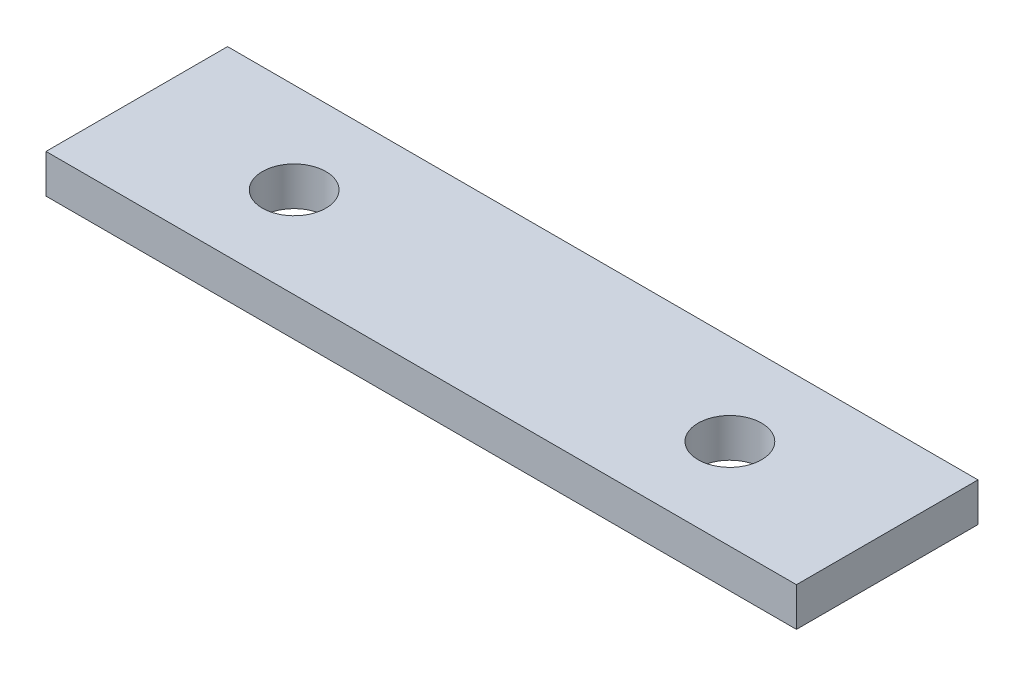
ISO-10303-21;
HEADER;
FILE_DESCRIPTION(('STEP AP214'),'2;1');
FILE_NAME('part.step','',(''),(''),'','','');
FILE_SCHEMA(('AUTOMOTIVE_DESIGN { 1 0 10303 214 1 1 1 1 }'));
ENDSEC;
DATA;
#1=APPLICATION_CONTEXT('core data for automotive mechanical design processes');
#2=APPLICATION_PROTOCOL_DEFINITION('international standard','automotive_design',2000,#1);
#3=PRODUCT_CONTEXT('',#1,'mechanical');
#4=PRODUCT('Part','Part','',(#3));
#5=PRODUCT_RELATED_PRODUCT_CATEGORY('part','',(#4));
#6=PRODUCT_DEFINITION_FORMATION('','',#4);
#7=PRODUCT_DEFINITION_CONTEXT('part definition',#1,'design');
#8=PRODUCT_DEFINITION('design','',#6,#7);
#9=PRODUCT_DEFINITION_SHAPE('','',#8);
#10=(LENGTH_UNIT() NAMED_UNIT(*) SI_UNIT(.MILLI.,.METRE.));
#11=(NAMED_UNIT(*) PLANE_ANGLE_UNIT() SI_UNIT($,.RADIAN.));
#12=(NAMED_UNIT(*) SI_UNIT($,.STERADIAN.) SOLID_ANGLE_UNIT());
#13=UNCERTAINTY_MEASURE_WITH_UNIT(LENGTH_MEASURE(1.E-05),#10,'distance_accuracy_value','');
#14=(GEOMETRIC_REPRESENTATION_CONTEXT(3) GLOBAL_UNCERTAINTY_ASSIGNED_CONTEXT((#13)) GLOBAL_UNIT_ASSIGNED_CONTEXT((#10,
#11,#12)) REPRESENTATION_CONTEXT('',''));
#15=CARTESIAN_POINT('',(0.,0.,0.));
#16=DIRECTION('',(0.,0.,1.));
#17=DIRECTION('',(1.,0.,0.));
#18=AXIS2_PLACEMENT_3D('',#15,#16,#17);
#19=CARTESIAN_POINT('',(31.,3.2,-7.5));
#20=DIRECTION('',(-1.,0.,0.));
#21=DIRECTION('',(0.,0.,1.));
#22=AXIS2_PLACEMENT_3D('',#19,#20,#21);
#23=PLANE('',#22);
#24=DIRECTION('',(0.,0.,-1.));
#25=VECTOR('',#24,1.);
#26=CARTESIAN_POINT('',(31.,0.,-7.5));
#27=LINE('',#26,#25);
#28=CARTESIAN_POINT('',(31.,0.,7.5));
#29=VERTEX_POINT('',#28);
#30=CARTESIAN_POINT('',(31.,0.,-7.5));
#31=VERTEX_POINT('',#30);
#32=EDGE_CURVE('E96',#29,#31,#27,.T.);
#33=ORIENTED_EDGE('',*,*,#32,.T.);
#34=DIRECTION('',(0.,-1.,0.));
#35=VECTOR('',#34,1.);
#36=CARTESIAN_POINT('',(31.,3.2,-7.5));
#37=LINE('',#36,#35);
#38=CARTESIAN_POINT('',(31.,3.2,-7.5));
#39=VERTEX_POINT('',#38);
#40=EDGE_CURVE('E11',#39,#31,#37,.T.);
#41=ORIENTED_EDGE('',*,*,#40,.F.);
#42=DIRECTION('',(0.,0.,-1.));
#43=VECTOR('',#42,1.);
#44=CARTESIAN_POINT('',(31.,3.2,-7.5));
#45=LINE('',#44,#43);
#46=CARTESIAN_POINT('',(31.,3.2,7.5));
#47=VERTEX_POINT('',#46);
#48=EDGE_CURVE('E84',#47,#39,#45,.T.);
#49=ORIENTED_EDGE('',*,*,#48,.F.);
#50=DIRECTION('',(0.,-1.,0.));
#51=VECTOR('',#50,1.);
#52=CARTESIAN_POINT('',(31.,3.2,7.5));
#53=LINE('',#52,#51);
#54=EDGE_CURVE('E92',#47,#29,#53,.T.);
#55=ORIENTED_EDGE('',*,*,#54,.T.);
#56=EDGE_LOOP('',(#33,#41,#49,#55));
#57=FACE_BOUND('',#56,.T.);
#58=ADVANCED_FACE('F33',(#57),#23,.F.);
#59=CARTESIAN_POINT('',(-31.,3.2,-7.5));
#60=DIRECTION('',(0.,0.,1.));
#61=DIRECTION('',(1.,0.,0.));
#62=AXIS2_PLACEMENT_3D('',#59,#60,#61);
#63=PLANE('',#62);
#64=DIRECTION('',(-1.,0.,0.));
#65=VECTOR('',#64,1.);
#66=CARTESIAN_POINT('',(-31.,0.,-7.5));
#67=LINE('',#66,#65);
#68=CARTESIAN_POINT('',(-31.,0.,-7.5));
#69=VERTEX_POINT('',#68);
#70=EDGE_CURVE('E88',#31,#69,#67,.T.);
#71=ORIENTED_EDGE('',*,*,#70,.T.);
#72=DIRECTION('',(0.,-1.,0.));
#73=VECTOR('',#72,1.);
#74=CARTESIAN_POINT('',(-31.,3.2,-7.5));
#75=LINE('',#74,#73);
#76=CARTESIAN_POINT('',(-31.,3.2,-7.5));
#77=VERTEX_POINT('',#76);
#78=EDGE_CURVE('E41',#77,#69,#75,.T.);
#79=ORIENTED_EDGE('',*,*,#78,.F.);
#80=DIRECTION('',(-1.,0.,0.));
#81=VECTOR('',#80,1.);
#82=CARTESIAN_POINT('',(-31.,3.2,-7.5));
#83=LINE('',#82,#81);
#84=EDGE_CURVE('E79',#39,#77,#83,.T.);
#85=ORIENTED_EDGE('',*,*,#84,.F.);
#86=ORIENTED_EDGE('',*,*,#40,.T.);
#87=EDGE_LOOP('',(#71,#79,#85,#86));
#88=FACE_BOUND('',#87,.T.);
#89=ADVANCED_FACE('F87',(#88),#63,.F.);
#90=CARTESIAN_POINT('',(-31.,3.2,-7.5));
#91=DIRECTION('',(1.,0.,0.));
#92=DIRECTION('',(0.,0.,-1.));
#93=AXIS2_PLACEMENT_3D('',#90,#91,#92);
#94=PLANE('',#93);
#95=DIRECTION('',(0.,0.,1.));
#96=VECTOR('',#95,1.);
#97=CARTESIAN_POINT('',(-31.,0.,-7.5));
#98=LINE('',#97,#96);
#99=CARTESIAN_POINT('',(-31.,0.,7.5));
#100=VERTEX_POINT('',#99);
#101=EDGE_CURVE('E66',#69,#100,#98,.T.);
#102=ORIENTED_EDGE('',*,*,#101,.T.);
#103=DIRECTION('',(0.,-1.,0.));
#104=VECTOR('',#103,1.);
#105=CARTESIAN_POINT('',(-31.,3.2,7.5));
#106=LINE('',#105,#104);
#107=CARTESIAN_POINT('',(-31.,3.2,7.5));
#108=VERTEX_POINT('',#107);
#109=EDGE_CURVE('E89',#108,#100,#106,.T.);
#110=ORIENTED_EDGE('',*,*,#109,.F.);
#111=DIRECTION('',(0.,0.,1.));
#112=VECTOR('',#111,1.);
#113=CARTESIAN_POINT('',(-31.,3.2,-7.5));
#114=LINE('',#113,#112);
#115=EDGE_CURVE('E82',#77,#108,#114,.T.);
#116=ORIENTED_EDGE('',*,*,#115,.F.);
#117=ORIENTED_EDGE('',*,*,#78,.T.);
#118=EDGE_LOOP('',(#102,#110,#116,#117));
#119=FACE_BOUND('',#118,.T.);
#120=ADVANCED_FACE('F90',(#119),#94,.F.);
#121=CARTESIAN_POINT('',(-31.,3.2,7.5));
#122=DIRECTION('',(0.,0.,-1.));
#123=DIRECTION('',(-1.,0.,0.));
#124=AXIS2_PLACEMENT_3D('',#121,#122,#123);
#125=PLANE('',#124);
#126=DIRECTION('',(1.,0.,0.));
#127=VECTOR('',#126,1.);
#128=CARTESIAN_POINT('',(-31.,0.,7.5));
#129=LINE('',#128,#127);
#130=EDGE_CURVE('E72',#100,#29,#129,.T.);
#131=ORIENTED_EDGE('',*,*,#130,.T.);
#132=ORIENTED_EDGE('',*,*,#54,.F.);
#133=DIRECTION('',(1.,0.,0.));
#134=VECTOR('',#133,1.);
#135=CARTESIAN_POINT('',(-31.,3.2,7.5));
#136=LINE('',#135,#134);
#137=EDGE_CURVE('E49',#108,#47,#136,.T.);
#138=ORIENTED_EDGE('',*,*,#137,.F.);
#139=ORIENTED_EDGE('',*,*,#109,.T.);
#140=EDGE_LOOP('',(#131,#132,#138,#139));
#141=FACE_BOUND('',#140,.T.);
#142=ADVANCED_FACE('F104',(#141),#125,.F.);
#143=CARTESIAN_POINT('',(0.,3.2,0.));
#144=DIRECTION('',(0.,1.,0.));
#145=DIRECTION('',(0.,0.,1.));
#146=AXIS2_PLACEMENT_3D('',#143,#144,#145);
#147=PLANE('',#146);
#148=CARTESIAN_POINT('',(18.,3.2,0.));
#149=DIRECTION('',(0.,1.,0.));
#150=DIRECTION('',(0.,0.,1.));
#151=AXIS2_PLACEMENT_3D('',#148,#149,#150);
#152=CIRCLE('',#151,2.625);
#153=CARTESIAN_POINT('',(18.,3.2,2.625));
#154=VERTEX_POINT('',#153);
#155=EDGE_CURVE('E118',#154,#154,#152,.T.);
#156=ORIENTED_EDGE('',*,*,#155,.F.);
#157=EDGE_LOOP('',(#156));
#158=FACE_BOUND('',#157,.T.);
#159=CARTESIAN_POINT('',(-18.,3.2,0.));
#160=DIRECTION('',(0.,1.,0.));
#161=DIRECTION('',(0.,0.,1.));
#162=AXIS2_PLACEMENT_3D('',#159,#160,#161);
#163=CIRCLE('',#162,2.625);
#164=CARTESIAN_POINT('',(-18.,3.2,2.625));
#165=VERTEX_POINT('',#164);
#166=EDGE_CURVE('E112',#165,#165,#163,.T.);
#167=ORIENTED_EDGE('',*,*,#166,.F.);
#168=EDGE_LOOP('',(#167));
#169=FACE_BOUND('',#168,.T.);
#170=ORIENTED_EDGE('',*,*,#48,.T.);
#171=ORIENTED_EDGE('',*,*,#84,.T.);
#172=ORIENTED_EDGE('',*,*,#115,.T.);
#173=ORIENTED_EDGE('',*,*,#137,.T.);
#174=EDGE_LOOP('',(#170,#171,#172,#173));
#175=FACE_BOUND('',#174,.T.);
#176=ADVANCED_FACE('F80',(#158,#169,#175),#147,.T.);
#177=CARTESIAN_POINT('',(0.,0.,0.));
#178=DIRECTION('',(0.,1.,0.));
#179=DIRECTION('',(0.,0.,1.));
#180=AXIS2_PLACEMENT_3D('',#177,#178,#179);
#181=PLANE('',#180);
#182=CARTESIAN_POINT('',(18.,0.,0.));
#183=DIRECTION('',(0.,1.,0.));
#184=DIRECTION('',(0.,0.,1.));
#185=AXIS2_PLACEMENT_3D('',#182,#183,#184);
#186=CIRCLE('',#185,2.625);
#187=CARTESIAN_POINT('',(18.,0.,2.625));
#188=VERTEX_POINT('',#187);
#189=EDGE_CURVE('E115',#188,#188,#186,.F.);
#190=ORIENTED_EDGE('',*,*,#189,.F.);
#191=EDGE_LOOP('',(#190));
#192=FACE_BOUND('',#191,.T.);
#193=CARTESIAN_POINT('',(-18.,0.,0.));
#194=DIRECTION('',(0.,1.,0.));
#195=DIRECTION('',(0.,0.,1.));
#196=AXIS2_PLACEMENT_3D('',#193,#194,#195);
#197=CIRCLE('',#196,2.625);
#198=CARTESIAN_POINT('',(-18.,0.,2.625));
#199=VERTEX_POINT('',#198);
#200=EDGE_CURVE('E99',#199,#199,#197,.F.);
#201=ORIENTED_EDGE('',*,*,#200,.F.);
#202=EDGE_LOOP('',(#201));
#203=FACE_BOUND('',#202,.T.);
#204=ORIENTED_EDGE('',*,*,#32,.F.);
#205=ORIENTED_EDGE('',*,*,#130,.F.);
#206=ORIENTED_EDGE('',*,*,#101,.F.);
#207=ORIENTED_EDGE('',*,*,#70,.F.);
#208=EDGE_LOOP('',(#204,#205,#206,#207));
#209=FACE_BOUND('',#208,.T.);
#210=ADVANCED_FACE('F107',(#192,#203,#209),#181,.F.);
#211=CARTESIAN_POINT('',(-18.,-0.00100000000000013,0.));
#212=DIRECTION('',(0.,1.,0.));
#213=DIRECTION('',(0.,0.,1.));
#214=AXIS2_PLACEMENT_3D('',#211,#212,#213);
#215=CYLINDRICAL_SURFACE('',#214,2.625);
#216=ORIENTED_EDGE('',*,*,#166,.T.);
#217=EDGE_LOOP('',(#216));
#218=FACE_BOUND('',#217,.T.);
#219=ORIENTED_EDGE('',*,*,#200,.T.);
#220=EDGE_LOOP('',(#219));
#221=FACE_BOUND('',#220,.T.);
#222=ADVANCED_FACE('F130',(#218,#221),#215,.F.);
#223=CARTESIAN_POINT('',(18.,-0.00100000000000013,0.));
#224=DIRECTION('',(0.,1.,0.));
#225=DIRECTION('',(0.,0.,1.));
#226=AXIS2_PLACEMENT_3D('',#223,#224,#225);
#227=CYLINDRICAL_SURFACE('',#226,2.625);
#228=ORIENTED_EDGE('',*,*,#155,.T.);
#229=EDGE_LOOP('',(#228));
#230=FACE_BOUND('',#229,.T.);
#231=ORIENTED_EDGE('',*,*,#189,.T.);
#232=EDGE_LOOP('',(#231));
#233=FACE_BOUND('',#232,.T.);
#234=ADVANCED_FACE('F122',(#230,#233),#227,.F.);
#235=CLOSED_SHELL('',(#58,#89,#120,#142,#176,#210,#222,#234));
#236=MANIFOLD_SOLID_BREP('B2',#235);
#237=ADVANCED_BREP_SHAPE_REPRESENTATION('',(#18,#236),#14);
#238=SHAPE_DEFINITION_REPRESENTATION(#9,#237);
ENDSEC;
END-ISO-10303-21;
